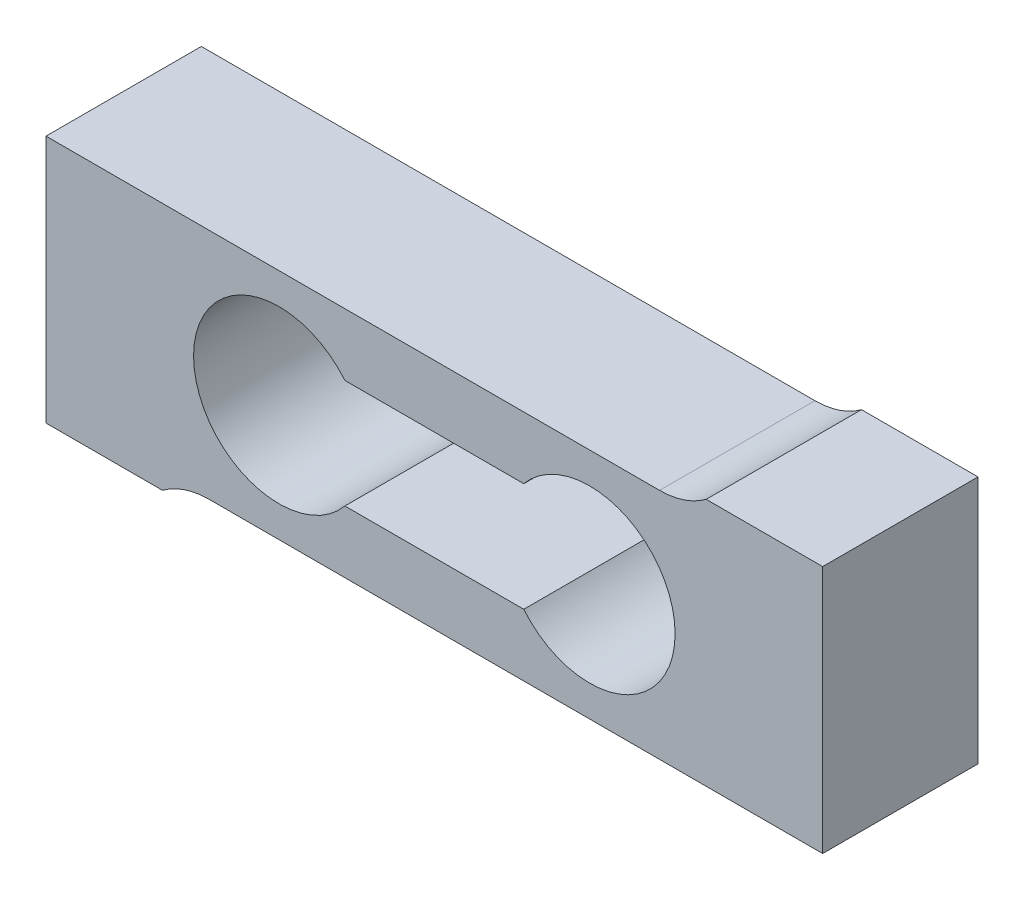
ISO-10303-21;
HEADER;
FILE_DESCRIPTION(('STEP AP214'),'2;1');
FILE_NAME('part.step','',(''),(''),'','','');
FILE_SCHEMA(('AUTOMOTIVE_DESIGN { 1 0 10303 214 1 1 1 1 }'));
ENDSEC;
DATA;
#1=APPLICATION_CONTEXT('core data for automotive mechanical design processes');
#2=APPLICATION_PROTOCOL_DEFINITION('international standard','automotive_design',2000,#1);
#3=PRODUCT_CONTEXT('',#1,'mechanical');
#4=PRODUCT('Part','Part','',(#3));
#5=PRODUCT_RELATED_PRODUCT_CATEGORY('part','',(#4));
#6=PRODUCT_DEFINITION_FORMATION('','',#4);
#7=PRODUCT_DEFINITION_CONTEXT('part definition',#1,'design');
#8=PRODUCT_DEFINITION('design','',#6,#7);
#9=PRODUCT_DEFINITION_SHAPE('','',#8);
#10=(LENGTH_UNIT() NAMED_UNIT(*) SI_UNIT(.MILLI.,.METRE.));
#11=(NAMED_UNIT(*) PLANE_ANGLE_UNIT() SI_UNIT($,.RADIAN.));
#12=(NAMED_UNIT(*) SI_UNIT($,.STERADIAN.) SOLID_ANGLE_UNIT());
#13=UNCERTAINTY_MEASURE_WITH_UNIT(LENGTH_MEASURE(1.E-05),#10,'distance_accuracy_value','');
#14=(GEOMETRIC_REPRESENTATION_CONTEXT(3) GLOBAL_UNCERTAINTY_ASSIGNED_CONTEXT((#13)) GLOBAL_UNIT_ASSIGNED_CONTEXT((#10,
#11,#12)) REPRESENTATION_CONTEXT('',''));
#15=CARTESIAN_POINT('',(0.,0.,0.));
#16=DIRECTION('',(0.,0.,1.));
#17=DIRECTION('',(1.,0.,0.));
#18=AXIS2_PLACEMENT_3D('',#15,#16,#17);
#19=CARTESIAN_POINT('',(-50.,15.,20.));
#20=DIRECTION('',(0.,-1.,0.));
#21=DIRECTION('',(0.,0.,-1.));
#22=AXIS2_PLACEMENT_3D('',#19,#20,#21);
#23=PLANE('',#22);
#24=DIRECTION('',(-1.,0.,0.));
#25=VECTOR('',#24,1.);
#26=CARTESIAN_POINT('',(-50.,15.,20.));
#27=LINE('',#26,#25);
#28=CARTESIAN_POINT('',(29.,15.,20.));
#29=VERTEX_POINT('',#28);
#30=CARTESIAN_POINT('',(-50.,15.,20.));
#31=VERTEX_POINT('',#30);
#32=EDGE_CURVE('E129',#29,#31,#27,.T.);
#33=ORIENTED_EDGE('',*,*,#32,.F.);
#34=DIRECTION('',(0.,0.,-1.));
#35=VECTOR('',#34,1.);
#36=CARTESIAN_POINT('',(29.,15.,20.));
#37=LINE('',#36,#35);
#38=CARTESIAN_POINT('',(29.,15.,0.));
#39=VERTEX_POINT('',#38);
#40=EDGE_CURVE('E207',#29,#39,#37,.T.);
#41=ORIENTED_EDGE('',*,*,#40,.T.);
#42=DIRECTION('',(-1.,0.,0.));
#43=VECTOR('',#42,1.);
#44=CARTESIAN_POINT('',(-50.,15.,0.));
#45=LINE('',#44,#43);
#46=CARTESIAN_POINT('',(-50.,15.,0.));
#47=VERTEX_POINT('',#46);
#48=EDGE_CURVE('E198',#39,#47,#45,.T.);
#49=ORIENTED_EDGE('',*,*,#48,.T.);
#50=DIRECTION('',(0.,0.,-1.));
#51=VECTOR('',#50,1.);
#52=CARTESIAN_POINT('',(-50.,15.,20.));
#53=LINE('',#52,#51);
#54=EDGE_CURVE('E204',#31,#47,#53,.T.);
#55=ORIENTED_EDGE('',*,*,#54,.F.);
#56=EDGE_LOOP('',(#33,#41,#49,#55));
#57=FACE_BOUND('',#56,.T.);
#58=ADVANCED_FACE('F33',(#57),#23,.F.);
#59=CARTESIAN_POINT('',(-50.,-15.,20.));
#60=DIRECTION('',(0.,1.,0.));
#61=DIRECTION('',(0.,0.,1.));
#62=AXIS2_PLACEMENT_3D('',#59,#60,#61);
#63=PLANE('',#62);
#64=DIRECTION('',(1.,0.,0.));
#65=VECTOR('',#64,1.);
#66=CARTESIAN_POINT('',(-50.,-15.,20.));
#67=LINE('',#66,#65);
#68=CARTESIAN_POINT('',(-29.,-15.,20.));
#69=VERTEX_POINT('',#68);
#70=CARTESIAN_POINT('',(50.,-15.,20.));
#71=VERTEX_POINT('',#70);
#72=EDGE_CURVE('E125',#69,#71,#67,.T.);
#73=ORIENTED_EDGE('',*,*,#72,.F.);
#74=DIRECTION('',(0.,0.,-1.));
#75=VECTOR('',#74,1.);
#76=CARTESIAN_POINT('',(-29.,-15.,20.));
#77=LINE('',#76,#75);
#78=CARTESIAN_POINT('',(-29.,-15.,0.));
#79=VERTEX_POINT('',#78);
#80=EDGE_CURVE('E54',#69,#79,#77,.T.);
#81=ORIENTED_EDGE('',*,*,#80,.T.);
#82=DIRECTION('',(1.,0.,0.));
#83=VECTOR('',#82,1.);
#84=CARTESIAN_POINT('',(-50.,-15.,0.));
#85=LINE('',#84,#83);
#86=CARTESIAN_POINT('',(50.,-15.,0.));
#87=VERTEX_POINT('',#86);
#88=EDGE_CURVE('E130',#79,#87,#85,.T.);
#89=ORIENTED_EDGE('',*,*,#88,.T.);
#90=DIRECTION('',(0.,0.,-1.));
#91=VECTOR('',#90,1.);
#92=CARTESIAN_POINT('',(50.,-15.,20.));
#93=LINE('',#92,#91);
#94=EDGE_CURVE('E196',#71,#87,#93,.T.);
#95=ORIENTED_EDGE('',*,*,#94,.F.);
#96=EDGE_LOOP('',(#73,#81,#89,#95));
#97=FACE_BOUND('',#96,.T.);
#98=ADVANCED_FACE('F236',(#97),#63,.F.);
#99=CARTESIAN_POINT('',(0.,0.,20.));
#100=DIRECTION('',(0.,0.,1.));
#101=DIRECTION('',(1.,0.,0.));
#102=AXIS2_PLACEMENT_3D('',#99,#100,#101);
#103=PLANE('',#102);
#104=DIRECTION('',(0.,1.,0.));
#105=VECTOR('',#104,1.);
#106=CARTESIAN_POINT('',(50.,15.,20.));
#107=LINE('',#106,#105);
#108=CARTESIAN_POINT('',(50.,17.,20.));
#109=VERTEX_POINT('',#108);
#110=EDGE_CURVE('E119',#71,#109,#107,.T.);
#111=ORIENTED_EDGE('',*,*,#110,.T.);
#112=DIRECTION('',(-1.,0.,0.));
#113=VECTOR('',#112,1.);
#114=CARTESIAN_POINT('',(50.,17.,20.));
#115=LINE('',#114,#113);
#116=CARTESIAN_POINT('',(35.,17.,20.));
#117=VERTEX_POINT('',#116);
#118=EDGE_CURVE('E124',#109,#117,#115,.T.);
#119=ORIENTED_EDGE('',*,*,#118,.T.);
#120=CARTESIAN_POINT('',(29.,25.,20.));
#121=DIRECTION('',(0.,0.,1.));
#122=DIRECTION('',(1.,0.,0.));
#123=AXIS2_PLACEMENT_3D('',#120,#121,#122);
#124=CIRCLE('',#123,10.);
#125=EDGE_CURVE('E210',#117,#29,#124,.F.);
#126=ORIENTED_EDGE('',*,*,#125,.T.);
#127=ORIENTED_EDGE('',*,*,#32,.T.);
#128=DIRECTION('',(0.,-1.,0.));
#129=VECTOR('',#128,1.);
#130=CARTESIAN_POINT('',(-50.,15.,20.));
#131=LINE('',#130,#129);
#132=CARTESIAN_POINT('',(-50.,-17.,20.));
#133=VERTEX_POINT('',#132);
#134=EDGE_CURVE('E193',#31,#133,#131,.T.);
#135=ORIENTED_EDGE('',*,*,#134,.T.);
#136=DIRECTION('',(1.,0.,0.));
#137=VECTOR('',#136,1.);
#138=CARTESIAN_POINT('',(-50.,-17.,20.));
#139=LINE('',#138,#137);
#140=CARTESIAN_POINT('',(-35.,-17.,20.));
#141=VERTEX_POINT('',#140);
#142=EDGE_CURVE('E155',#133,#141,#139,.T.);
#143=ORIENTED_EDGE('',*,*,#142,.T.);
#144=CARTESIAN_POINT('',(-29.,-25.,20.));
#145=DIRECTION('',(0.,0.,1.));
#146=DIRECTION('',(1.,0.,0.));
#147=AXIS2_PLACEMENT_3D('',#144,#145,#146);
#148=CIRCLE('',#147,10.);
#149=EDGE_CURVE('E41',#141,#69,#148,.F.);
#150=ORIENTED_EDGE('',*,*,#149,.T.);
#151=ORIENTED_EDGE('',*,*,#72,.T.);
#152=EDGE_LOOP('',(#111,#119,#126,#127,#135,#143,#150,#151));
#153=FACE_BOUND('',#152,.T.);
#154=DIRECTION('',(-1.,0.,0.));
#155=VECTOR('',#154,1.);
#156=CARTESIAN_POINT('',(-11.5147186257614,7.,20.));
#157=LINE('',#156,#155);
#158=CARTESIAN_POINT('',(11.5147186257614,7.,20.));
#159=VERTEX_POINT('',#158);
#160=CARTESIAN_POINT('',(-11.5147186257614,7.,20.));
#161=VERTEX_POINT('',#160);
#162=EDGE_CURVE('E164',#159,#161,#157,.T.);
#163=ORIENTED_EDGE('',*,*,#162,.F.);
#164=CARTESIAN_POINT('',(20.,0.,20.));
#165=DIRECTION('',(0.,0.,1.));
#166=DIRECTION('',(1.,0.,0.));
#167=AXIS2_PLACEMENT_3D('',#164,#165,#166);
#168=CIRCLE('',#167,11.);
#169=CARTESIAN_POINT('',(11.5147186257614,-7.,20.));
#170=VERTEX_POINT('',#169);
#171=EDGE_CURVE('E162',#170,#159,#168,.T.);
#172=ORIENTED_EDGE('',*,*,#171,.F.);
#173=DIRECTION('',(1.,0.,0.));
#174=VECTOR('',#173,1.);
#175=CARTESIAN_POINT('',(-11.5147186257614,-7.,20.));
#176=LINE('',#175,#174);
#177=CARTESIAN_POINT('',(-11.5147186257614,-7.,20.));
#178=VERTEX_POINT('',#177);
#179=EDGE_CURVE('E170',#178,#170,#176,.T.);
#180=ORIENTED_EDGE('',*,*,#179,.F.);
#181=CARTESIAN_POINT('',(-20.,0.,20.));
#182=DIRECTION('',(0.,0.,1.));
#183=DIRECTION('',(1.,0.,0.));
#184=AXIS2_PLACEMENT_3D('',#181,#182,#183);
#185=CIRCLE('',#184,11.);
#186=EDGE_CURVE('E167',#161,#178,#185,.T.);
#187=ORIENTED_EDGE('',*,*,#186,.F.);
#188=EDGE_LOOP('',(#163,#172,#180,#187));
#189=FACE_BOUND('',#188,.T.);
#190=ADVANCED_FACE('F121',(#153,#189),#103,.T.);
#191=CARTESIAN_POINT('',(0.,0.,0.));
#192=DIRECTION('',(0.,0.,1.));
#193=DIRECTION('',(1.,0.,0.));
#194=AXIS2_PLACEMENT_3D('',#191,#192,#193);
#195=PLANE('',#194);
#196=DIRECTION('',(0.,1.,0.));
#197=VECTOR('',#196,1.);
#198=CARTESIAN_POINT('',(50.,15.,0.));
#199=LINE('',#198,#197);
#200=CARTESIAN_POINT('',(50.,17.,0.));
#201=VERTEX_POINT('',#200);
#202=EDGE_CURVE('E136',#87,#201,#199,.T.);
#203=ORIENTED_EDGE('',*,*,#202,.F.);
#204=ORIENTED_EDGE('',*,*,#88,.F.);
#205=CARTESIAN_POINT('',(-29.,-25.,0.));
#206=DIRECTION('',(0.,0.,1.));
#207=DIRECTION('',(1.,0.,0.));
#208=AXIS2_PLACEMENT_3D('',#205,#206,#207);
#209=CIRCLE('',#208,10.);
#210=CARTESIAN_POINT('',(-35.,-17.,0.));
#211=VERTEX_POINT('',#210);
#212=EDGE_CURVE('E11',#79,#211,#209,.T.);
#213=ORIENTED_EDGE('',*,*,#212,.T.);
#214=DIRECTION('',(-1.,0.,0.));
#215=VECTOR('',#214,1.);
#216=CARTESIAN_POINT('',(-50.,-17.,0.));
#217=LINE('',#216,#215);
#218=CARTESIAN_POINT('',(-50.,-17.,0.));
#219=VERTEX_POINT('',#218);
#220=EDGE_CURVE('E150',#211,#219,#217,.T.);
#221=ORIENTED_EDGE('',*,*,#220,.T.);
#222=DIRECTION('',(0.,-1.,0.));
#223=VECTOR('',#222,1.);
#224=CARTESIAN_POINT('',(-50.,15.,0.));
#225=LINE('',#224,#223);
#226=EDGE_CURVE('E200',#47,#219,#225,.T.);
#227=ORIENTED_EDGE('',*,*,#226,.F.);
#228=ORIENTED_EDGE('',*,*,#48,.F.);
#229=CARTESIAN_POINT('',(29.,25.,0.));
#230=DIRECTION('',(0.,0.,1.));
#231=DIRECTION('',(1.,0.,0.));
#232=AXIS2_PLACEMENT_3D('',#229,#230,#231);
#233=CIRCLE('',#232,10.);
#234=CARTESIAN_POINT('',(35.,17.,0.));
#235=VERTEX_POINT('',#234);
#236=EDGE_CURVE('E212',#39,#235,#233,.T.);
#237=ORIENTED_EDGE('',*,*,#236,.T.);
#238=DIRECTION('',(1.,0.,0.));
#239=VECTOR('',#238,1.);
#240=CARTESIAN_POINT('',(50.,17.,0.));
#241=LINE('',#240,#239);
#242=EDGE_CURVE('E148',#235,#201,#241,.T.);
#243=ORIENTED_EDGE('',*,*,#242,.T.);
#244=EDGE_LOOP('',(#203,#204,#213,#221,#227,#228,#237,#243));
#245=FACE_BOUND('',#244,.T.);
#246=CARTESIAN_POINT('',(20.,0.,0.));
#247=DIRECTION('',(0.,0.,1.));
#248=DIRECTION('',(1.,0.,0.));
#249=AXIS2_PLACEMENT_3D('',#246,#247,#248);
#250=CIRCLE('',#249,11.);
#251=CARTESIAN_POINT('',(11.5147186257614,-7.,0.));
#252=VERTEX_POINT('',#251);
#253=CARTESIAN_POINT('',(11.5147186257614,7.,0.));
#254=VERTEX_POINT('',#253);
#255=EDGE_CURVE('E153',#252,#254,#250,.T.);
#256=ORIENTED_EDGE('',*,*,#255,.T.);
#257=DIRECTION('',(-1.,0.,0.));
#258=VECTOR('',#257,1.);
#259=CARTESIAN_POINT('',(-11.5147186257614,7.,0.));
#260=LINE('',#259,#258);
#261=CARTESIAN_POINT('',(-11.5147186257614,7.,0.));
#262=VERTEX_POINT('',#261);
#263=EDGE_CURVE('E175',#254,#262,#260,.T.);
#264=ORIENTED_EDGE('',*,*,#263,.T.);
#265=CARTESIAN_POINT('',(-20.,0.,0.));
#266=DIRECTION('',(0.,0.,1.));
#267=DIRECTION('',(1.,0.,0.));
#268=AXIS2_PLACEMENT_3D('',#265,#266,#267);
#269=CIRCLE('',#268,11.);
#270=CARTESIAN_POINT('',(-11.5147186257614,-7.,0.));
#271=VERTEX_POINT('',#270);
#272=EDGE_CURVE('E178',#262,#271,#269,.T.);
#273=ORIENTED_EDGE('',*,*,#272,.T.);
#274=DIRECTION('',(1.,0.,0.));
#275=VECTOR('',#274,1.);
#276=CARTESIAN_POINT('',(-11.5147186257614,-7.,0.));
#277=LINE('',#276,#275);
#278=EDGE_CURVE('E165',#271,#252,#277,.T.);
#279=ORIENTED_EDGE('',*,*,#278,.T.);
#280=EDGE_LOOP('',(#256,#264,#273,#279));
#281=FACE_BOUND('',#280,.T.);
#282=ADVANCED_FACE('F216',(#245,#281),#195,.F.);
#283=CARTESIAN_POINT('',(50.,15.,20.));
#284=DIRECTION('',(-1.,0.,0.));
#285=DIRECTION('',(0.,0.,1.));
#286=AXIS2_PLACEMENT_3D('',#283,#284,#285);
#287=PLANE('',#286);
#288=ORIENTED_EDGE('',*,*,#202,.T.);
#289=DIRECTION('',(0.,0.,1.));
#290=VECTOR('',#289,1.);
#291=CARTESIAN_POINT('',(50.,17.,-15.1327459504216));
#292=LINE('',#291,#290);
#293=EDGE_CURVE('E133',#201,#109,#292,.T.);
#294=ORIENTED_EDGE('',*,*,#293,.T.);
#295=ORIENTED_EDGE('',*,*,#110,.F.);
#296=ORIENTED_EDGE('',*,*,#94,.T.);
#297=EDGE_LOOP('',(#288,#294,#295,#296));
#298=FACE_BOUND('',#297,.T.);
#299=ADVANCED_FACE('F134',(#298),#287,.F.);
#300=CARTESIAN_POINT('',(-50.,15.,20.));
#301=DIRECTION('',(1.,0.,0.));
#302=DIRECTION('',(0.,1.,0.));
#303=AXIS2_PLACEMENT_3D('',#300,#301,#302);
#304=PLANE('',#303);
#305=ORIENTED_EDGE('',*,*,#226,.T.);
#306=DIRECTION('',(0.,0.,1.));
#307=VECTOR('',#306,1.);
#308=CARTESIAN_POINT('',(-50.,-17.,-15.1327459504216));
#309=LINE('',#308,#307);
#310=EDGE_CURVE('E157',#219,#133,#309,.T.);
#311=ORIENTED_EDGE('',*,*,#310,.T.);
#312=ORIENTED_EDGE('',*,*,#134,.F.);
#313=ORIENTED_EDGE('',*,*,#54,.T.);
#314=EDGE_LOOP('',(#305,#311,#312,#313));
#315=FACE_BOUND('',#314,.T.);
#316=ADVANCED_FACE('F227',(#315),#304,.F.);
#317=CARTESIAN_POINT('',(20.,0.,20.));
#318=DIRECTION('',(0.,0.,-1.));
#319=DIRECTION('',(-1.,0.,0.));
#320=AXIS2_PLACEMENT_3D('',#317,#318,#319);
#321=CYLINDRICAL_SURFACE('',#320,11.);
#322=ORIENTED_EDGE('',*,*,#255,.F.);
#323=DIRECTION('',(0.,0.,-1.));
#324=VECTOR('',#323,1.);
#325=CARTESIAN_POINT('',(11.5147186257614,-7.,20.));
#326=LINE('',#325,#324);
#327=EDGE_CURVE('E172',#170,#252,#326,.T.);
#328=ORIENTED_EDGE('',*,*,#327,.F.);
#329=ORIENTED_EDGE('',*,*,#171,.T.);
#330=DIRECTION('',(0.,0.,-1.));
#331=VECTOR('',#330,1.);
#332=CARTESIAN_POINT('',(11.5147186257614,7.,20.));
#333=LINE('',#332,#331);
#334=EDGE_CURVE('E189',#159,#254,#333,.T.);
#335=ORIENTED_EDGE('',*,*,#334,.T.);
#336=EDGE_LOOP('',(#322,#328,#329,#335));
#337=FACE_BOUND('',#336,.T.);
#338=ADVANCED_FACE('F248',(#337),#321,.F.);
#339=CARTESIAN_POINT('',(-11.5147186257614,7.,20.));
#340=DIRECTION('',(0.,-1.,0.));
#341=DIRECTION('',(0.,0.,-1.));
#342=AXIS2_PLACEMENT_3D('',#339,#340,#341);
#343=PLANE('',#342);
#344=ORIENTED_EDGE('',*,*,#263,.F.);
#345=ORIENTED_EDGE('',*,*,#334,.F.);
#346=ORIENTED_EDGE('',*,*,#162,.T.);
#347=DIRECTION('',(0.,0.,-1.));
#348=VECTOR('',#347,1.);
#349=CARTESIAN_POINT('',(-11.5147186257614,7.,20.));
#350=LINE('',#349,#348);
#351=EDGE_CURVE('E187',#161,#262,#350,.T.);
#352=ORIENTED_EDGE('',*,*,#351,.T.);
#353=EDGE_LOOP('',(#344,#345,#346,#352));
#354=FACE_BOUND('',#353,.T.);
#355=ADVANCED_FACE('F269',(#354),#343,.T.);
#356=CARTESIAN_POINT('',(-20.,0.,20.));
#357=DIRECTION('',(0.,0.,-1.));
#358=DIRECTION('',(-1.,0.,0.));
#359=AXIS2_PLACEMENT_3D('',#356,#357,#358);
#360=CYLINDRICAL_SURFACE('',#359,11.);
#361=ORIENTED_EDGE('',*,*,#272,.F.);
#362=ORIENTED_EDGE('',*,*,#351,.F.);
#363=ORIENTED_EDGE('',*,*,#186,.T.);
#364=DIRECTION('',(0.,0.,-1.));
#365=VECTOR('',#364,1.);
#366=CARTESIAN_POINT('',(-11.5147186257614,-7.,20.));
#367=LINE('',#366,#365);
#368=EDGE_CURVE('E185',#178,#271,#367,.T.);
#369=ORIENTED_EDGE('',*,*,#368,.T.);
#370=EDGE_LOOP('',(#361,#362,#363,#369));
#371=FACE_BOUND('',#370,.T.);
#372=ADVANCED_FACE('F265',(#371),#360,.F.);
#373=CARTESIAN_POINT('',(-11.5147186257614,-7.,20.));
#374=DIRECTION('',(0.,1.,0.));
#375=DIRECTION('',(0.,0.,1.));
#376=AXIS2_PLACEMENT_3D('',#373,#374,#375);
#377=PLANE('',#376);
#378=ORIENTED_EDGE('',*,*,#278,.F.);
#379=ORIENTED_EDGE('',*,*,#368,.F.);
#380=ORIENTED_EDGE('',*,*,#179,.T.);
#381=ORIENTED_EDGE('',*,*,#327,.T.);
#382=EDGE_LOOP('',(#378,#379,#380,#381));
#383=FACE_BOUND('',#382,.T.);
#384=ADVANCED_FACE('F260',(#383),#377,.T.);
#385=CARTESIAN_POINT('',(-50.,-17.,-15.1327459504216));
#386=DIRECTION('',(0.,-1.,0.));
#387=DIRECTION('',(0.,0.,-1.));
#388=AXIS2_PLACEMENT_3D('',#385,#386,#387);
#389=PLANE('',#388);
#390=ORIENTED_EDGE('',*,*,#220,.F.);
#391=DIRECTION('',(0.,0.,1.));
#392=VECTOR('',#391,1.);
#393=CARTESIAN_POINT('',(-35.,-17.,-15.1327459504216));
#394=LINE('',#393,#392);
#395=EDGE_CURVE('E154',#211,#141,#394,.T.);
#396=ORIENTED_EDGE('',*,*,#395,.T.);
#397=ORIENTED_EDGE('',*,*,#142,.F.);
#398=ORIENTED_EDGE('',*,*,#310,.F.);
#399=EDGE_LOOP('',(#390,#396,#397,#398));
#400=FACE_BOUND('',#399,.T.);
#401=ADVANCED_FACE('F232',(#400),#389,.T.);
#402=CARTESIAN_POINT('',(50.,17.,-15.1327459504216));
#403=DIRECTION('',(0.,1.,0.));
#404=DIRECTION('',(-1.,0.,0.));
#405=AXIS2_PLACEMENT_3D('',#402,#403,#404);
#406=PLANE('',#405);
#407=ORIENTED_EDGE('',*,*,#242,.F.);
#408=DIRECTION('',(0.,0.,1.));
#409=VECTOR('',#408,1.);
#410=CARTESIAN_POINT('',(35.,17.,-15.1327459504216));
#411=LINE('',#410,#409);
#412=EDGE_CURVE('E140',#235,#117,#411,.T.);
#413=ORIENTED_EDGE('',*,*,#412,.T.);
#414=ORIENTED_EDGE('',*,*,#118,.F.);
#415=ORIENTED_EDGE('',*,*,#293,.F.);
#416=EDGE_LOOP('',(#407,#413,#414,#415));
#417=FACE_BOUND('',#416,.T.);
#418=ADVANCED_FACE('F143',(#417),#406,.T.);
#419=CARTESIAN_POINT('',(29.,25.,-15.1327459504216));
#420=DIRECTION('',(0.,0.,-1.));
#421=DIRECTION('',(-1.,0.,0.));
#422=AXIS2_PLACEMENT_3D('',#419,#420,#421);
#423=CYLINDRICAL_SURFACE('',#422,10.);
#424=ORIENTED_EDGE('',*,*,#236,.F.);
#425=ORIENTED_EDGE('',*,*,#40,.F.);
#426=ORIENTED_EDGE('',*,*,#125,.F.);
#427=ORIENTED_EDGE('',*,*,#412,.F.);
#428=EDGE_LOOP('',(#424,#425,#426,#427));
#429=FACE_BOUND('',#428,.T.);
#430=ADVANCED_FACE('F221',(#429),#423,.F.);
#431=CARTESIAN_POINT('',(-29.,-25.,-15.1327459504216));
#432=DIRECTION('',(0.,0.,-1.));
#433=DIRECTION('',(-1.,0.,0.));
#434=AXIS2_PLACEMENT_3D('',#431,#432,#433);
#435=CYLINDRICAL_SURFACE('',#434,10.);
#436=ORIENTED_EDGE('',*,*,#212,.F.);
#437=ORIENTED_EDGE('',*,*,#80,.F.);
#438=ORIENTED_EDGE('',*,*,#149,.F.);
#439=ORIENTED_EDGE('',*,*,#395,.F.);
#440=EDGE_LOOP('',(#436,#437,#438,#439));
#441=FACE_BOUND('',#440,.T.);
#442=ADVANCED_FACE('F35',(#441),#435,.F.);
#443=CLOSED_SHELL('',(#58,#98,#190,#282,#299,#316,#338,#355,#372,#384,#401,#418,#430,#442));
#444=MANIFOLD_SOLID_BREP('B2',#443);
#445=ADVANCED_BREP_SHAPE_REPRESENTATION('',(#18,#444),#14);
#446=SHAPE_DEFINITION_REPRESENTATION(#9,#445);
ENDSEC;
END-ISO-10303-21;
